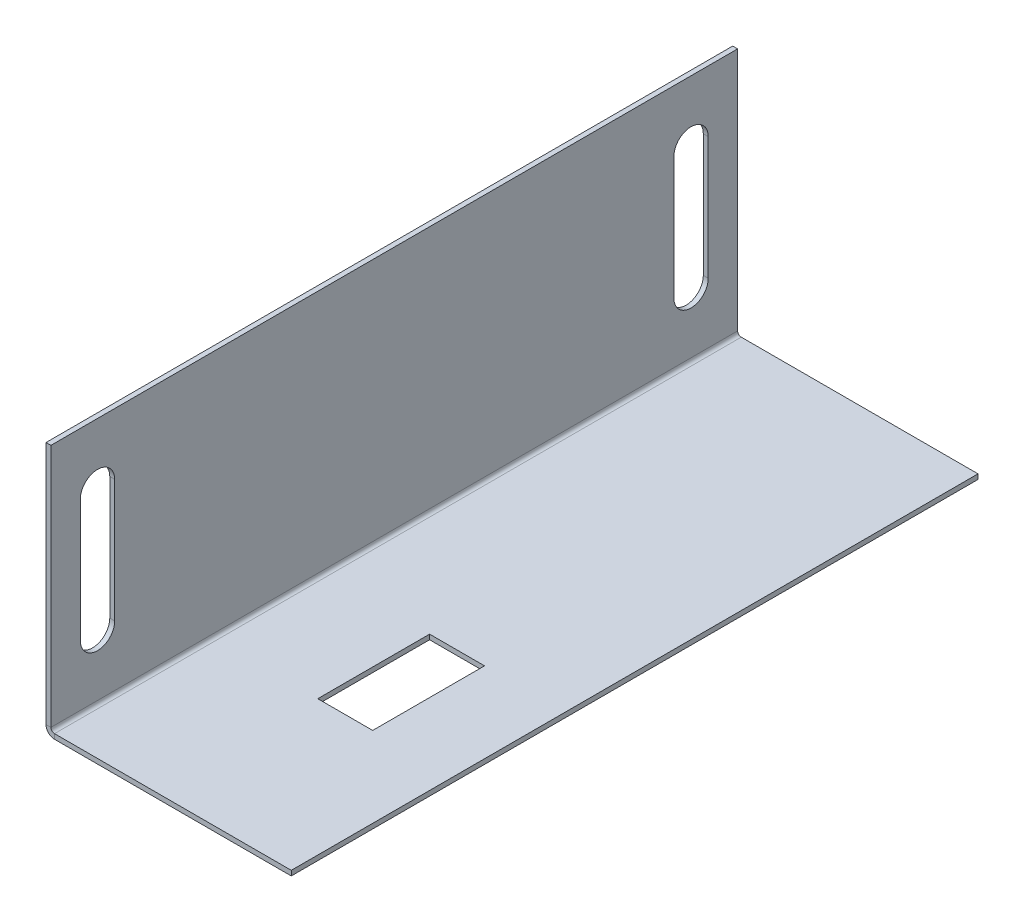
ISO-10303-21;
HEADER;
FILE_DESCRIPTION(('STEP AP214'),'2;1');
FILE_NAME('part.step','',(''),(''),'','','');
FILE_SCHEMA(('AUTOMOTIVE_DESIGN { 1 0 10303 214 1 1 1 1 }'));
ENDSEC;
DATA;
#1=APPLICATION_CONTEXT('core data for automotive mechanical design processes');
#2=APPLICATION_PROTOCOL_DEFINITION('international standard','automotive_design',2000,#1);
#3=PRODUCT_CONTEXT('',#1,'mechanical');
#4=PRODUCT('Part','Part','',(#3));
#5=PRODUCT_RELATED_PRODUCT_CATEGORY('part','',(#4));
#6=PRODUCT_DEFINITION_FORMATION('','',#4);
#7=PRODUCT_DEFINITION_CONTEXT('part definition',#1,'design');
#8=PRODUCT_DEFINITION('design','',#6,#7);
#9=PRODUCT_DEFINITION_SHAPE('','',#8);
#10=(LENGTH_UNIT() NAMED_UNIT(*) SI_UNIT(.MILLI.,.METRE.));
#11=(NAMED_UNIT(*) PLANE_ANGLE_UNIT() SI_UNIT($,.RADIAN.));
#12=(NAMED_UNIT(*) SI_UNIT($,.STERADIAN.) SOLID_ANGLE_UNIT());
#13=UNCERTAINTY_MEASURE_WITH_UNIT(LENGTH_MEASURE(1.E-05),#10,'distance_accuracy_value','');
#14=(GEOMETRIC_REPRESENTATION_CONTEXT(3) GLOBAL_UNCERTAINTY_ASSIGNED_CONTEXT((#13)) GLOBAL_UNIT_ASSIGNED_CONTEXT((#10,
#11,#12)) REPRESENTATION_CONTEXT('',''));
#15=CARTESIAN_POINT('',(0.,0.,0.));
#16=DIRECTION('',(0.,0.,1.));
#17=DIRECTION('',(1.,0.,0.));
#18=AXIS2_PLACEMENT_3D('',#15,#16,#17);
#19=CARTESIAN_POINT('',(50.0000000000002,50.5307532622854,-140.));
#20=DIRECTION('',(0.,0.,-1.));
#21=DIRECTION('',(0.,1.,0.));
#22=AXIS2_PLACEMENT_3D('',#19,#20,#21);
#23=PLANE('',#22);
#24=DIRECTION('',(0.,1.,0.));
#25=VECTOR('',#24,1.);
#26=CARTESIAN_POINT('',(51.0000000000002,50.5307532622854,-140.));
#27=LINE('',#26,#25);
#28=CARTESIAN_POINT('',(51.,0.736600000000005,-140.));
#29=VERTEX_POINT('',#28);
#30=CARTESIAN_POINT('',(51.0000000000002,50.5307532622854,-140.));
#31=VERTEX_POINT('',#30);
#32=EDGE_CURVE('E328',#29,#31,#27,.T.);
#33=ORIENTED_EDGE('',*,*,#32,.F.);
#34=DIRECTION('',(-1.,0.,0.));
#35=VECTOR('',#34,1.);
#36=CARTESIAN_POINT('',(50.,0.736600000000004,-140.));
#37=LINE('',#36,#35);
#38=CARTESIAN_POINT('',(50.,0.736600000000011,-140.));
#39=VERTEX_POINT('',#38);
#40=EDGE_CURVE('E340',#29,#39,#37,.T.);
#41=ORIENTED_EDGE('',*,*,#40,.T.);
#42=DIRECTION('',(0.,1.,0.));
#43=VECTOR('',#42,1.);
#44=CARTESIAN_POINT('',(50.0000000000002,50.5307532622854,-140.));
#45=LINE('',#44,#43);
#46=CARTESIAN_POINT('',(50.0000000000002,50.5307532622854,-140.));
#47=VERTEX_POINT('',#46);
#48=EDGE_CURVE('E46',#39,#47,#45,.T.);
#49=ORIENTED_EDGE('',*,*,#48,.T.);
#50=DIRECTION('',(1.,0.,0.));
#51=VECTOR('',#50,1.);
#52=CARTESIAN_POINT('',(50.0000000000002,50.5307532622854,-140.));
#53=LINE('',#52,#51);
#54=EDGE_CURVE('E332',#47,#31,#53,.T.);
#55=ORIENTED_EDGE('',*,*,#54,.T.);
#56=EDGE_LOOP('',(#33,#41,#49,#55));
#57=FACE_BOUND('',#56,.T.);
#58=ADVANCED_FACE('F42',(#57),#23,.T.);
#59=CARTESIAN_POINT('',(50.0000000000002,50.5307532622854,0.));
#60=DIRECTION('',(0.,0.,1.));
#61=DIRECTION('',(0.,-1.,0.));
#62=AXIS2_PLACEMENT_3D('',#59,#60,#61);
#63=PLANE('',#62);
#64=DIRECTION('',(0.,-1.,0.));
#65=VECTOR('',#64,1.);
#66=CARTESIAN_POINT('',(50.0000000000002,50.5307532622854,0.));
#67=LINE('',#66,#65);
#68=CARTESIAN_POINT('',(50.0000000000002,50.5307532622854,0.));
#69=VERTEX_POINT('',#68);
#70=CARTESIAN_POINT('',(50.,0.736600000000004,0.));
#71=VERTEX_POINT('',#70);
#72=EDGE_CURVE('E327',#69,#71,#67,.T.);
#73=ORIENTED_EDGE('',*,*,#72,.T.);
#74=DIRECTION('',(1.,0.,0.));
#75=VECTOR('',#74,1.);
#76=CARTESIAN_POINT('',(50.,0.736600000000004,0.));
#77=LINE('',#76,#75);
#78=CARTESIAN_POINT('',(51.,0.736600000000005,0.));
#79=VERTEX_POINT('',#78);
#80=EDGE_CURVE('E12',#71,#79,#77,.T.);
#81=ORIENTED_EDGE('',*,*,#80,.T.);
#82=DIRECTION('',(0.,-1.,0.));
#83=VECTOR('',#82,1.);
#84=CARTESIAN_POINT('',(51.0000000000002,50.5307532622854,0.));
#85=LINE('',#84,#83);
#86=CARTESIAN_POINT('',(51.0000000000002,50.5307532622854,0.));
#87=VERTEX_POINT('',#86);
#88=EDGE_CURVE('E331',#87,#79,#85,.T.);
#89=ORIENTED_EDGE('',*,*,#88,.F.);
#90=DIRECTION('',(1.,0.,0.));
#91=VECTOR('',#90,1.);
#92=CARTESIAN_POINT('',(50.0000000000002,50.5307532622854,0.));
#93=LINE('',#92,#91);
#94=EDGE_CURVE('E336',#69,#87,#93,.T.);
#95=ORIENTED_EDGE('',*,*,#94,.F.);
#96=EDGE_LOOP('',(#73,#81,#89,#95));
#97=FACE_BOUND('',#96,.T.);
#98=ADVANCED_FACE('F44',(#97),#63,.T.);
#99=CARTESIAN_POINT('',(50.0000000000002,50.5307532622854,0.));
#100=DIRECTION('',(-1.,0.,0.));
#101=DIRECTION('',(0.,0.,-1.));
#102=AXIS2_PLACEMENT_3D('',#99,#100,#101);
#103=PLANE('',#102);
#104=CARTESIAN_POINT('',(50.0000000000001,38.0307532622854,-130.5));
#105=DIRECTION('',(-1.,0.,0.));
#106=DIRECTION('',(0.,-1.,0.));
#107=AXIS2_PLACEMENT_3D('',#104,#105,#106);
#108=CIRCLE('',#107,3.5);
#109=CARTESIAN_POINT('',(50.0000000000001,38.0307532622854,-134.));
#110=VERTEX_POINT('',#109);
#111=CARTESIAN_POINT('',(50.0000000000001,38.0307532622854,-127.));
#112=VERTEX_POINT('',#111);
#113=EDGE_CURVE('E223',#110,#112,#108,.F.);
#114=ORIENTED_EDGE('',*,*,#113,.T.);
#115=DIRECTION('',(0.,-1.,0.));
#116=VECTOR('',#115,1.);
#117=CARTESIAN_POINT('',(50.0000000000001,38.0307532622854,-127.));
#118=LINE('',#117,#116);
#119=CARTESIAN_POINT('',(50.,13.0307532622854,-127.));
#120=VERTEX_POINT('',#119);
#121=EDGE_CURVE('E240',#112,#120,#118,.T.);
#122=ORIENTED_EDGE('',*,*,#121,.T.);
#123=CARTESIAN_POINT('',(50.,13.0307532622854,-130.5));
#124=DIRECTION('',(-1.,0.,0.));
#125=DIRECTION('',(0.,-1.,0.));
#126=AXIS2_PLACEMENT_3D('',#123,#124,#125);
#127=CIRCLE('',#126,3.5);
#128=CARTESIAN_POINT('',(50.,13.0307532622854,-134.));
#129=VERTEX_POINT('',#128);
#130=EDGE_CURVE('E195',#120,#129,#127,.F.);
#131=ORIENTED_EDGE('',*,*,#130,.T.);
#132=DIRECTION('',(0.,1.,0.));
#133=VECTOR('',#132,1.);
#134=CARTESIAN_POINT('',(50.0000000000001,38.0307532622854,-134.));
#135=LINE('',#134,#133);
#136=EDGE_CURVE('E220',#129,#110,#135,.T.);
#137=ORIENTED_EDGE('',*,*,#136,.T.);
#138=EDGE_LOOP('',(#114,#122,#131,#137));
#139=FACE_BOUND('',#138,.T.);
#140=CARTESIAN_POINT('',(50.0000000000001,38.0307532622854,-9.50000000000001));
#141=DIRECTION('',(-1.,0.,0.));
#142=DIRECTION('',(0.,-1.,0.));
#143=AXIS2_PLACEMENT_3D('',#140,#141,#142);
#144=CIRCLE('',#143,3.5);
#145=CARTESIAN_POINT('',(50.0000000000001,38.0307532622854,-13.));
#146=VERTEX_POINT('',#145);
#147=CARTESIAN_POINT('',(50.0000000000001,38.0307532622854,-6.00000000000001));
#148=VERTEX_POINT('',#147);
#149=EDGE_CURVE('E255',#146,#148,#144,.F.);
#150=ORIENTED_EDGE('',*,*,#149,.T.);
#151=DIRECTION('',(0.,-1.,0.));
#152=VECTOR('',#151,1.);
#153=CARTESIAN_POINT('',(50.0000000000001,38.0307532622854,-6.00000000000001));
#154=LINE('',#153,#152);
#155=CARTESIAN_POINT('',(50.,13.0307532622854,-6.00000000000001));
#156=VERTEX_POINT('',#155);
#157=EDGE_CURVE('E272',#148,#156,#154,.T.);
#158=ORIENTED_EDGE('',*,*,#157,.T.);
#159=CARTESIAN_POINT('',(50.,13.0307532622854,-9.50000000000001));
#160=DIRECTION('',(-1.,0.,0.));
#161=DIRECTION('',(0.,-1.,0.));
#162=AXIS2_PLACEMENT_3D('',#159,#160,#161);
#163=CIRCLE('',#162,3.5);
#164=CARTESIAN_POINT('',(50.,13.0307532622854,-13.));
#165=VERTEX_POINT('',#164);
#166=EDGE_CURVE('E249',#156,#165,#163,.F.);
#167=ORIENTED_EDGE('',*,*,#166,.T.);
#168=DIRECTION('',(0.,1.,0.));
#169=VECTOR('',#168,1.);
#170=CARTESIAN_POINT('',(50.0000000000001,38.0307532622854,-13.));
#171=LINE('',#170,#169);
#172=EDGE_CURVE('E252',#165,#146,#171,.T.);
#173=ORIENTED_EDGE('',*,*,#172,.T.);
#174=EDGE_LOOP('',(#150,#158,#167,#173));
#175=FACE_BOUND('',#174,.T.);
#176=ORIENTED_EDGE('',*,*,#48,.F.);
#177=DIRECTION('',(0.,0.,1.));
#178=VECTOR('',#177,1.);
#179=CARTESIAN_POINT('',(50.,0.736600000000004,0.));
#180=LINE('',#179,#178);
#181=EDGE_CURVE('E335',#39,#71,#180,.T.);
#182=ORIENTED_EDGE('',*,*,#181,.T.);
#183=ORIENTED_EDGE('',*,*,#72,.F.);
#184=DIRECTION('',(0.,0.,1.));
#185=VECTOR('',#184,1.);
#186=CARTESIAN_POINT('',(50.0000000000002,50.5307532622854,0.));
#187=LINE('',#186,#185);
#188=EDGE_CURVE('E324',#47,#69,#187,.T.);
#189=ORIENTED_EDGE('',*,*,#188,.F.);
#190=EDGE_LOOP('',(#176,#182,#183,#189));
#191=FACE_BOUND('',#190,.T.);
#192=ADVANCED_FACE('F367',(#139,#175,#191),#103,.T.);
#193=CARTESIAN_POINT('',(50.0000000000002,50.5307532622854,0.));
#194=DIRECTION('',(0.,1.,0.));
#195=DIRECTION('',(0.,0.,1.));
#196=AXIS2_PLACEMENT_3D('',#193,#194,#195);
#197=PLANE('',#196);
#198=DIRECTION('',(0.,0.,1.));
#199=VECTOR('',#198,1.);
#200=CARTESIAN_POINT('',(51.0000000000002,50.5307532622854,0.));
#201=LINE('',#200,#199);
#202=EDGE_CURVE('E296',#31,#87,#201,.T.);
#203=ORIENTED_EDGE('',*,*,#202,.F.);
#204=ORIENTED_EDGE('',*,*,#54,.F.);
#205=ORIENTED_EDGE('',*,*,#188,.T.);
#206=ORIENTED_EDGE('',*,*,#94,.T.);
#207=EDGE_LOOP('',(#203,#204,#205,#206));
#208=FACE_BOUND('',#207,.T.);
#209=ADVANCED_FACE('F357',(#208),#197,.T.);
#210=CARTESIAN_POINT('',(51.0000000000002,50.5307532622854,0.));
#211=DIRECTION('',(-1.,0.,0.));
#212=DIRECTION('',(0.,0.,-1.));
#213=AXIS2_PLACEMENT_3D('',#210,#211,#212);
#214=PLANE('',#213);
#215=DIRECTION('',(0.,-1.,0.));
#216=VECTOR('',#215,1.);
#217=CARTESIAN_POINT('',(51.0000000000001,38.0307532622854,-127.));
#218=LINE('',#217,#216);
#219=CARTESIAN_POINT('',(51.0000000000001,38.0307532622854,-127.));
#220=VERTEX_POINT('',#219);
#221=CARTESIAN_POINT('',(51.,13.0307532622854,-127.));
#222=VERTEX_POINT('',#221);
#223=EDGE_CURVE('E228',#220,#222,#218,.T.);
#224=ORIENTED_EDGE('',*,*,#223,.F.);
#225=CARTESIAN_POINT('',(51.0000000000001,38.0307532622854,-130.5));
#226=DIRECTION('',(1.,0.,0.));
#227=DIRECTION('',(0.,-1.,0.));
#228=AXIS2_PLACEMENT_3D('',#225,#226,#227);
#229=CIRCLE('',#228,3.5);
#230=CARTESIAN_POINT('',(51.0000000000001,38.0307532622854,-134.));
#231=VERTEX_POINT('',#230);
#232=EDGE_CURVE('E226',#231,#220,#229,.T.);
#233=ORIENTED_EDGE('',*,*,#232,.F.);
#234=DIRECTION('',(0.,1.,0.));
#235=VECTOR('',#234,1.);
#236=CARTESIAN_POINT('',(51.0000000000001,38.0307532622854,-134.));
#237=LINE('',#236,#235);
#238=CARTESIAN_POINT('',(51.,13.0307532622854,-134.));
#239=VERTEX_POINT('',#238);
#240=EDGE_CURVE('E234',#239,#231,#237,.T.);
#241=ORIENTED_EDGE('',*,*,#240,.F.);
#242=CARTESIAN_POINT('',(51.,13.0307532622854,-130.5));
#243=DIRECTION('',(1.,0.,0.));
#244=DIRECTION('',(0.,-1.,0.));
#245=AXIS2_PLACEMENT_3D('',#242,#243,#244);
#246=CIRCLE('',#245,3.5);
#247=EDGE_CURVE('E231',#222,#239,#246,.T.);
#248=ORIENTED_EDGE('',*,*,#247,.F.);
#249=EDGE_LOOP('',(#224,#233,#241,#248));
#250=FACE_BOUND('',#249,.T.);
#251=DIRECTION('',(0.,-1.,0.));
#252=VECTOR('',#251,1.);
#253=CARTESIAN_POINT('',(51.0000000000001,38.0307532622854,-6.00000000000001));
#254=LINE('',#253,#252);
#255=CARTESIAN_POINT('',(51.0000000000001,38.0307532622854,-6.00000000000001));
#256=VERTEX_POINT('',#255);
#257=CARTESIAN_POINT('',(51.,13.0307532622854,-6.00000000000001));
#258=VERTEX_POINT('',#257);
#259=EDGE_CURVE('E260',#256,#258,#254,.T.);
#260=ORIENTED_EDGE('',*,*,#259,.F.);
#261=CARTESIAN_POINT('',(51.0000000000001,38.0307532622854,-9.50000000000001));
#262=DIRECTION('',(1.,0.,0.));
#263=DIRECTION('',(0.,1.,0.));
#264=AXIS2_PLACEMENT_3D('',#261,#262,#263);
#265=CIRCLE('',#264,3.5);
#266=CARTESIAN_POINT('',(51.0000000000001,38.0307532622854,-13.));
#267=VERTEX_POINT('',#266);
#268=EDGE_CURVE('E258',#267,#256,#265,.T.);
#269=ORIENTED_EDGE('',*,*,#268,.F.);
#270=DIRECTION('',(0.,1.,0.));
#271=VECTOR('',#270,1.);
#272=CARTESIAN_POINT('',(51.0000000000001,38.0307532622854,-13.));
#273=LINE('',#272,#271);
#274=CARTESIAN_POINT('',(51.,13.0307532622854,-13.));
#275=VERTEX_POINT('',#274);
#276=EDGE_CURVE('E266',#275,#267,#273,.T.);
#277=ORIENTED_EDGE('',*,*,#276,.F.);
#278=CARTESIAN_POINT('',(51.,13.0307532622854,-9.50000000000001));
#279=DIRECTION('',(1.,0.,0.));
#280=DIRECTION('',(0.,1.,0.));
#281=AXIS2_PLACEMENT_3D('',#278,#279,#280);
#282=CIRCLE('',#281,3.5);
#283=EDGE_CURVE('E263',#258,#275,#282,.T.);
#284=ORIENTED_EDGE('',*,*,#283,.F.);
#285=EDGE_LOOP('',(#260,#269,#277,#284));
#286=FACE_BOUND('',#285,.T.);
#287=DIRECTION('',(0.,0.,1.));
#288=VECTOR('',#287,1.);
#289=CARTESIAN_POINT('',(51.,0.736599999999997,0.));
#290=LINE('',#289,#288);
#291=EDGE_CURVE('E51',#29,#79,#290,.T.);
#292=ORIENTED_EDGE('',*,*,#291,.F.);
#293=ORIENTED_EDGE('',*,*,#32,.T.);
#294=ORIENTED_EDGE('',*,*,#202,.T.);
#295=ORIENTED_EDGE('',*,*,#88,.T.);
#296=EDGE_LOOP('',(#292,#293,#294,#295));
#297=FACE_BOUND('',#296,.T.);
#298=ADVANCED_FACE('F350',(#250,#286,#297),#214,.F.);
#299=CARTESIAN_POINT('',(100.,-1.,0.));
#300=DIRECTION('',(1.,0.,0.));
#301=DIRECTION('',(0.,0.,-1.));
#302=AXIS2_PLACEMENT_3D('',#299,#300,#301);
#303=PLANE('',#302);
#304=DIRECTION('',(0.,0.,-1.));
#305=VECTOR('',#304,1.);
#306=CARTESIAN_POINT('',(100.,0.,0.));
#307=LINE('',#306,#305);
#308=CARTESIAN_POINT('',(100.,0.,0.));
#309=VERTEX_POINT('',#308);
#310=CARTESIAN_POINT('',(100.,0.,-140.));
#311=VERTEX_POINT('',#310);
#312=EDGE_CURVE('E299',#309,#311,#307,.T.);
#313=ORIENTED_EDGE('',*,*,#312,.F.);
#314=DIRECTION('',(0.,1.,0.));
#315=VECTOR('',#314,1.);
#316=CARTESIAN_POINT('',(100.,-1.,0.));
#317=LINE('',#316,#315);
#318=CARTESIAN_POINT('',(100.,-1.,0.));
#319=VERTEX_POINT('',#318);
#320=EDGE_CURVE('E293',#319,#309,#317,.T.);
#321=ORIENTED_EDGE('',*,*,#320,.F.);
#322=DIRECTION('',(0.,0.,-1.));
#323=VECTOR('',#322,1.);
#324=CARTESIAN_POINT('',(100.,-1.,0.));
#325=LINE('',#324,#323);
#326=CARTESIAN_POINT('',(100.,-1.,-140.));
#327=VERTEX_POINT('',#326);
#328=EDGE_CURVE('E313',#319,#327,#325,.T.);
#329=ORIENTED_EDGE('',*,*,#328,.T.);
#330=DIRECTION('',(0.,1.,0.));
#331=VECTOR('',#330,1.);
#332=CARTESIAN_POINT('',(100.,-1.,-140.));
#333=LINE('',#332,#331);
#334=EDGE_CURVE('E311',#327,#311,#333,.T.);
#335=ORIENTED_EDGE('',*,*,#334,.T.);
#336=EDGE_LOOP('',(#313,#321,#329,#335));
#337=FACE_BOUND('',#336,.T.);
#338=ADVANCED_FACE('F392',(#337),#303,.T.);
#339=CARTESIAN_POINT('',(0.,-1.,0.));
#340=DIRECTION('',(0.,-1.,0.));
#341=DIRECTION('',(0.,0.,-1.));
#342=AXIS2_PLACEMENT_3D('',#339,#340,#341);
#343=PLANE('',#342);
#344=DIRECTION('',(0.,0.,1.));
#345=VECTOR('',#344,1.);
#346=CARTESIAN_POINT('',(83.6,-1.,-55.8));
#347=LINE('',#346,#345);
#348=CARTESIAN_POINT('',(83.6,-1.,-55.8));
#349=VERTEX_POINT('',#348);
#350=CARTESIAN_POINT('',(83.6,-1.,-33.));
#351=VERTEX_POINT('',#350);
#352=EDGE_CURVE('E59',#349,#351,#347,.T.);
#353=ORIENTED_EDGE('',*,*,#352,.F.);
#354=DIRECTION('',(1.,0.,0.));
#355=VECTOR('',#354,1.);
#356=CARTESIAN_POINT('',(72.4,-1.,-55.8));
#357=LINE('',#356,#355);
#358=CARTESIAN_POINT('',(72.4,-1.,-55.8));
#359=VERTEX_POINT('',#358);
#360=EDGE_CURVE('E189',#359,#349,#357,.T.);
#361=ORIENTED_EDGE('',*,*,#360,.F.);
#362=DIRECTION('',(0.,0.,-1.));
#363=VECTOR('',#362,1.);
#364=CARTESIAN_POINT('',(72.4,-1.,-55.8));
#365=LINE('',#364,#363);
#366=CARTESIAN_POINT('',(72.4,-1.,-33.));
#367=VERTEX_POINT('',#366);
#368=EDGE_CURVE('E209',#367,#359,#365,.T.);
#369=ORIENTED_EDGE('',*,*,#368,.F.);
#370=DIRECTION('',(-1.,0.,0.));
#371=VECTOR('',#370,1.);
#372=CARTESIAN_POINT('',(72.4,-1.,-33.));
#373=LINE('',#372,#371);
#374=EDGE_CURVE('E203',#351,#367,#373,.T.);
#375=ORIENTED_EDGE('',*,*,#374,.F.);
#376=EDGE_LOOP('',(#353,#361,#369,#375));
#377=FACE_BOUND('',#376,.T.);
#378=DIRECTION('',(0.,0.,1.));
#379=VECTOR('',#378,1.);
#380=CARTESIAN_POINT('',(51.7366,-1.,0.));
#381=LINE('',#380,#379);
#382=CARTESIAN_POINT('',(51.7366,-0.999999999999999,-140.));
#383=VERTEX_POINT('',#382);
#384=CARTESIAN_POINT('',(51.7366,-1.,0.));
#385=VERTEX_POINT('',#384);
#386=EDGE_CURVE('E288',#383,#385,#381,.T.);
#387=ORIENTED_EDGE('',*,*,#386,.F.);
#388=DIRECTION('',(-1.,0.,0.));
#389=VECTOR('',#388,1.);
#390=CARTESIAN_POINT('',(0.,-1.,-140.));
#391=LINE('',#390,#389);
#392=EDGE_CURVE('E309',#327,#383,#391,.T.);
#393=ORIENTED_EDGE('',*,*,#392,.F.);
#394=ORIENTED_EDGE('',*,*,#328,.F.);
#395=DIRECTION('',(1.,0.,0.));
#396=VECTOR('',#395,1.);
#397=CARTESIAN_POINT('',(0.,-1.,0.));
#398=LINE('',#397,#396);
#399=EDGE_CURVE('E297',#385,#319,#398,.T.);
#400=ORIENTED_EDGE('',*,*,#399,.F.);
#401=EDGE_LOOP('',(#387,#393,#394,#400));
#402=FACE_BOUND('',#401,.T.);
#403=ADVANCED_FACE('F388',(#377,#402),#343,.T.);
#404=CARTESIAN_POINT('',(0.,-1.,-140.));
#405=DIRECTION('',(0.,0.,-1.));
#406=DIRECTION('',(-1.,0.,0.));
#407=AXIS2_PLACEMENT_3D('',#404,#405,#406);
#408=PLANE('',#407);
#409=DIRECTION('',(0.,-1.,0.));
#410=VECTOR('',#409,1.);
#411=CARTESIAN_POINT('',(51.7366,-1.,-140.));
#412=LINE('',#411,#410);
#413=CARTESIAN_POINT('',(51.7366,0.,-140.));
#414=VERTEX_POINT('',#413);
#415=EDGE_CURVE('E316',#414,#383,#412,.T.);
#416=ORIENTED_EDGE('',*,*,#415,.F.);
#417=DIRECTION('',(-1.,0.,0.));
#418=VECTOR('',#417,1.);
#419=CARTESIAN_POINT('',(0.,0.,-140.));
#420=LINE('',#419,#418);
#421=EDGE_CURVE('E307',#311,#414,#420,.T.);
#422=ORIENTED_EDGE('',*,*,#421,.F.);
#423=ORIENTED_EDGE('',*,*,#334,.F.);
#424=ORIENTED_EDGE('',*,*,#392,.T.);
#425=EDGE_LOOP('',(#416,#422,#423,#424));
#426=FACE_BOUND('',#425,.T.);
#427=ADVANCED_FACE('F378',(#426),#408,.T.);
#428=CARTESIAN_POINT('',(0.,0.,0.));
#429=DIRECTION('',(0.,-1.,0.));
#430=DIRECTION('',(0.,0.,-1.));
#431=AXIS2_PLACEMENT_3D('',#428,#429,#430);
#432=PLANE('',#431);
#433=DIRECTION('',(-1.,0.,0.));
#434=VECTOR('',#433,1.);
#435=CARTESIAN_POINT('',(72.4,0.,-55.8));
#436=LINE('',#435,#434);
#437=CARTESIAN_POINT('',(83.6,0.,-55.8));
#438=VERTEX_POINT('',#437);
#439=CARTESIAN_POINT('',(72.4,0.,-55.8));
#440=VERTEX_POINT('',#439);
#441=EDGE_CURVE('E201',#438,#440,#436,.T.);
#442=ORIENTED_EDGE('',*,*,#441,.F.);
#443=DIRECTION('',(0.,0.,-1.));
#444=VECTOR('',#443,1.);
#445=CARTESIAN_POINT('',(83.6,0.,-55.8));
#446=LINE('',#445,#444);
#447=CARTESIAN_POINT('',(83.6,0.,-33.));
#448=VERTEX_POINT('',#447);
#449=EDGE_CURVE('E183',#448,#438,#446,.T.);
#450=ORIENTED_EDGE('',*,*,#449,.F.);
#451=DIRECTION('',(1.,0.,0.));
#452=VECTOR('',#451,1.);
#453=CARTESIAN_POINT('',(72.4,0.,-33.));
#454=LINE('',#453,#452);
#455=CARTESIAN_POINT('',(72.4,0.,-33.));
#456=VERTEX_POINT('',#455);
#457=EDGE_CURVE('E192',#456,#448,#454,.T.);
#458=ORIENTED_EDGE('',*,*,#457,.F.);
#459=DIRECTION('',(0.,0.,1.));
#460=VECTOR('',#459,1.);
#461=CARTESIAN_POINT('',(72.4,0.,-55.8));
#462=LINE('',#461,#460);
#463=EDGE_CURVE('E67',#440,#456,#462,.T.);
#464=ORIENTED_EDGE('',*,*,#463,.F.);
#465=EDGE_LOOP('',(#442,#450,#458,#464));
#466=FACE_BOUND('',#465,.T.);
#467=ORIENTED_EDGE('',*,*,#421,.T.);
#468=DIRECTION('',(0.,0.,1.));
#469=VECTOR('',#468,1.);
#470=CARTESIAN_POINT('',(51.7366,0.,0.));
#471=LINE('',#470,#469);
#472=CARTESIAN_POINT('',(51.7366,0.,0.));
#473=VERTEX_POINT('',#472);
#474=EDGE_CURVE('E304',#414,#473,#471,.T.);
#475=ORIENTED_EDGE('',*,*,#474,.T.);
#476=DIRECTION('',(1.,0.,0.));
#477=VECTOR('',#476,1.);
#478=CARTESIAN_POINT('',(0.,0.,0.));
#479=LINE('',#478,#477);
#480=EDGE_CURVE('E302',#473,#309,#479,.T.);
#481=ORIENTED_EDGE('',*,*,#480,.T.);
#482=ORIENTED_EDGE('',*,*,#312,.T.);
#483=EDGE_LOOP('',(#467,#475,#481,#482));
#484=FACE_BOUND('',#483,.T.);
#485=ADVANCED_FACE('F198',(#466,#484),#432,.F.);
#486=CARTESIAN_POINT('',(0.,-1.,0.));
#487=DIRECTION('',(0.,0.,1.));
#488=DIRECTION('',(1.,0.,0.));
#489=AXIS2_PLACEMENT_3D('',#486,#487,#488);
#490=PLANE('',#489);
#491=DIRECTION('',(0.,1.,0.));
#492=VECTOR('',#491,1.);
#493=CARTESIAN_POINT('',(51.7366,-1.,0.));
#494=LINE('',#493,#492);
#495=EDGE_CURVE('E319',#385,#473,#494,.T.);
#496=ORIENTED_EDGE('',*,*,#495,.F.);
#497=ORIENTED_EDGE('',*,*,#399,.T.);
#498=ORIENTED_EDGE('',*,*,#320,.T.);
#499=ORIENTED_EDGE('',*,*,#480,.F.);
#500=EDGE_LOOP('',(#496,#497,#498,#499));
#501=FACE_BOUND('',#500,.T.);
#502=ADVANCED_FACE('F385',(#501),#490,.T.);
#503=CARTESIAN_POINT('',(51.7366,0.7366,-140.));
#504=DIRECTION('',(0.,0.,-1.));
#505=DIRECTION('',(-1.,0.,0.));
#506=AXIS2_PLACEMENT_3D('',#503,#504,#505);
#507=PLANE('',#506);
#508=ORIENTED_EDGE('',*,*,#40,.F.);
#509=CARTESIAN_POINT('',(51.7366,0.7366,-140.));
#510=DIRECTION('',(0.,0.,-1.));
#511=DIRECTION('',(-1.,0.,0.));
#512=AXIS2_PLACEMENT_3D('',#509,#510,#511);
#513=CIRCLE('',#512,0.7366);
#514=EDGE_CURVE('E281',#29,#414,#513,.F.);
#515=ORIENTED_EDGE('',*,*,#514,.T.);
#516=ORIENTED_EDGE('',*,*,#415,.T.);
#517=CARTESIAN_POINT('',(51.7366,0.7366,-140.));
#518=DIRECTION('',(0.,0.,1.));
#519=DIRECTION('',(-1.,0.,0.));
#520=AXIS2_PLACEMENT_3D('',#517,#518,#519);
#521=CIRCLE('',#520,1.7366);
#522=EDGE_CURVE('E282',#39,#383,#521,.T.);
#523=ORIENTED_EDGE('',*,*,#522,.F.);
#524=EDGE_LOOP('',(#508,#515,#516,#523));
#525=FACE_BOUND('',#524,.T.);
#526=ADVANCED_FACE('F372',(#525),#507,.T.);
#527=CARTESIAN_POINT('',(51.7366,0.7366,0.));
#528=DIRECTION('',(0.,0.,1.));
#529=DIRECTION('',(1.,0.,0.));
#530=AXIS2_PLACEMENT_3D('',#527,#528,#529);
#531=PLANE('',#530);
#532=CARTESIAN_POINT('',(51.7366,0.7366,0.));
#533=DIRECTION('',(0.,0.,-1.));
#534=DIRECTION('',(-1.,0.,0.));
#535=AXIS2_PLACEMENT_3D('',#532,#533,#534);
#536=CIRCLE('',#535,0.7366);
#537=EDGE_CURVE('E286',#473,#79,#536,.T.);
#538=ORIENTED_EDGE('',*,*,#537,.T.);
#539=ORIENTED_EDGE('',*,*,#80,.F.);
#540=CARTESIAN_POINT('',(51.7366,0.7366,0.));
#541=DIRECTION('',(0.,0.,-1.));
#542=DIRECTION('',(1.,0.,0.));
#543=AXIS2_PLACEMENT_3D('',#540,#541,#542);
#544=CIRCLE('',#543,1.7366);
#545=EDGE_CURVE('E285',#385,#71,#544,.T.);
#546=ORIENTED_EDGE('',*,*,#545,.F.);
#547=ORIENTED_EDGE('',*,*,#495,.T.);
#548=EDGE_LOOP('',(#538,#539,#546,#547));
#549=FACE_BOUND('',#548,.T.);
#550=ADVANCED_FACE('F364',(#549),#531,.T.);
#551=CARTESIAN_POINT('',(51.7366,0.7366,70.0170457456122));
#552=DIRECTION('',(0.,0.,-1.));
#553=DIRECTION('',(-1.,0.,0.));
#554=AXIS2_PLACEMENT_3D('',#551,#552,#553);
#555=CYLINDRICAL_SURFACE('',#554,1.7366);
#556=ORIENTED_EDGE('',*,*,#386,.T.);
#557=ORIENTED_EDGE('',*,*,#545,.T.);
#558=ORIENTED_EDGE('',*,*,#181,.F.);
#559=ORIENTED_EDGE('',*,*,#522,.T.);
#560=EDGE_LOOP('',(#556,#557,#558,#559));
#561=FACE_BOUND('',#560,.T.);
#562=ADVANCED_FACE('F370',(#561),#555,.T.);
#563=CARTESIAN_POINT('',(51.7366,0.7366,70.0170457456122));
#564=DIRECTION('',(0.,0.,-1.));
#565=DIRECTION('',(-1.,0.,0.));
#566=AXIS2_PLACEMENT_3D('',#563,#564,#565);
#567=CYLINDRICAL_SURFACE('',#566,0.7366);
#568=ORIENTED_EDGE('',*,*,#474,.F.);
#569=ORIENTED_EDGE('',*,*,#514,.F.);
#570=ORIENTED_EDGE('',*,*,#291,.T.);
#571=ORIENTED_EDGE('',*,*,#537,.F.);
#572=EDGE_LOOP('',(#568,#569,#570,#571));
#573=FACE_BOUND('',#572,.T.);
#574=ADVANCED_FACE('F382',(#573),#567,.F.);
#575=CARTESIAN_POINT('',(49.999,38.0307532622854,-9.50000000000001));
#576=DIRECTION('',(1.,0.,0.));
#577=DIRECTION('',(0.,1.,0.));
#578=AXIS2_PLACEMENT_3D('',#575,#576,#577);
#579=CYLINDRICAL_SURFACE('',#578,3.5);
#580=DIRECTION('',(1.,0.,0.));
#581=VECTOR('',#580,1.);
#582=CARTESIAN_POINT('',(49.999,38.0307532622854,-13.));
#583=LINE('',#582,#581);
#584=EDGE_CURVE('E270',#146,#267,#583,.T.);
#585=ORIENTED_EDGE('',*,*,#584,.T.);
#586=ORIENTED_EDGE('',*,*,#268,.T.);
#587=DIRECTION('',(1.,0.,0.));
#588=VECTOR('',#587,1.);
#589=CARTESIAN_POINT('',(49.999,38.0307532622854,-6.00000000000001));
#590=LINE('',#589,#588);
#591=EDGE_CURVE('E269',#148,#256,#590,.T.);
#592=ORIENTED_EDGE('',*,*,#591,.F.);
#593=ORIENTED_EDGE('',*,*,#149,.F.);
#594=EDGE_LOOP('',(#585,#586,#592,#593));
#595=FACE_BOUND('',#594,.T.);
#596=ADVANCED_FACE('F455',(#595),#579,.F.);
#597=CARTESIAN_POINT('',(49.999,38.0307532622854,-13.));
#598=DIRECTION('',(0.,0.,-1.));
#599=DIRECTION('',(-1.,0.,0.));
#600=AXIS2_PLACEMENT_3D('',#597,#598,#599);
#601=PLANE('',#600);
#602=DIRECTION('',(1.,0.,0.));
#603=VECTOR('',#602,1.);
#604=CARTESIAN_POINT('',(49.9989999999999,13.0307532622854,-13.));
#605=LINE('',#604,#603);
#606=EDGE_CURVE('E273',#165,#275,#605,.T.);
#607=ORIENTED_EDGE('',*,*,#606,.T.);
#608=ORIENTED_EDGE('',*,*,#276,.T.);
#609=ORIENTED_EDGE('',*,*,#584,.F.);
#610=ORIENTED_EDGE('',*,*,#172,.F.);
#611=EDGE_LOOP('',(#607,#608,#609,#610));
#612=FACE_BOUND('',#611,.T.);
#613=ADVANCED_FACE('F463',(#612),#601,.F.);
#614=CARTESIAN_POINT('',(49.9989999999999,13.0307532622854,-9.50000000000001));
#615=DIRECTION('',(1.,0.,0.));
#616=DIRECTION('',(0.,1.,0.));
#617=AXIS2_PLACEMENT_3D('',#614,#615,#616);
#618=CYLINDRICAL_SURFACE('',#617,3.5);
#619=DIRECTION('',(1.,0.,0.));
#620=VECTOR('',#619,1.);
#621=CARTESIAN_POINT('',(49.9989999999999,13.0307532622854,-6.00000000000001));
#622=LINE('',#621,#620);
#623=EDGE_CURVE('E275',#156,#258,#622,.T.);
#624=ORIENTED_EDGE('',*,*,#623,.T.);
#625=ORIENTED_EDGE('',*,*,#283,.T.);
#626=ORIENTED_EDGE('',*,*,#606,.F.);
#627=ORIENTED_EDGE('',*,*,#166,.F.);
#628=EDGE_LOOP('',(#624,#625,#626,#627));
#629=FACE_BOUND('',#628,.T.);
#630=ADVANCED_FACE('F472',(#629),#618,.F.);
#631=CARTESIAN_POINT('',(49.999,38.0307532622854,-6.00000000000001));
#632=DIRECTION('',(0.,0.,1.));
#633=DIRECTION('',(1.,0.,0.));
#634=AXIS2_PLACEMENT_3D('',#631,#632,#633);
#635=PLANE('',#634);
#636=ORIENTED_EDGE('',*,*,#591,.T.);
#637=ORIENTED_EDGE('',*,*,#259,.T.);
#638=ORIENTED_EDGE('',*,*,#623,.F.);
#639=ORIENTED_EDGE('',*,*,#157,.F.);
#640=EDGE_LOOP('',(#636,#637,#638,#639));
#641=FACE_BOUND('',#640,.T.);
#642=ADVANCED_FACE('F480',(#641),#635,.F.);
#643=CARTESIAN_POINT('',(49.9989999999999,38.0307532622854,-130.5));
#644=DIRECTION('',(1.,0.,0.));
#645=DIRECTION('',(0.,1.,0.));
#646=AXIS2_PLACEMENT_3D('',#643,#644,#645);
#647=CYLINDRICAL_SURFACE('',#646,3.5);
#648=DIRECTION('',(1.,0.,0.));
#649=VECTOR('',#648,1.);
#650=CARTESIAN_POINT('',(49.9989999999999,38.0307532622854,-134.));
#651=LINE('',#650,#649);
#652=EDGE_CURVE('E238',#110,#231,#651,.T.);
#653=ORIENTED_EDGE('',*,*,#652,.T.);
#654=ORIENTED_EDGE('',*,*,#232,.T.);
#655=DIRECTION('',(1.,0.,0.));
#656=VECTOR('',#655,1.);
#657=CARTESIAN_POINT('',(49.9989999999999,38.0307532622854,-127.));
#658=LINE('',#657,#656);
#659=EDGE_CURVE('E237',#112,#220,#658,.T.);
#660=ORIENTED_EDGE('',*,*,#659,.F.);
#661=ORIENTED_EDGE('',*,*,#113,.F.);
#662=EDGE_LOOP('',(#653,#654,#660,#661));
#663=FACE_BOUND('',#662,.T.);
#664=ADVANCED_FACE('F488',(#663),#647,.F.);
#665=CARTESIAN_POINT('',(49.9989999999999,38.0307532622854,-134.));
#666=DIRECTION('',(0.,0.,-1.));
#667=DIRECTION('',(-1.,0.,0.));
#668=AXIS2_PLACEMENT_3D('',#665,#666,#667);
#669=PLANE('',#668);
#670=DIRECTION('',(1.,0.,0.));
#671=VECTOR('',#670,1.);
#672=CARTESIAN_POINT('',(49.9989999999999,13.0307532622854,-134.));
#673=LINE('',#672,#671);
#674=EDGE_CURVE('E241',#129,#239,#673,.T.);
#675=ORIENTED_EDGE('',*,*,#674,.T.);
#676=ORIENTED_EDGE('',*,*,#240,.T.);
#677=ORIENTED_EDGE('',*,*,#652,.F.);
#678=ORIENTED_EDGE('',*,*,#136,.F.);
#679=EDGE_LOOP('',(#675,#676,#677,#678));
#680=FACE_BOUND('',#679,.T.);
#681=ADVANCED_FACE('F496',(#680),#669,.F.);
#682=CARTESIAN_POINT('',(49.9989999999999,13.0307532622854,-130.5));
#683=DIRECTION('',(1.,0.,0.));
#684=DIRECTION('',(0.,1.,0.));
#685=AXIS2_PLACEMENT_3D('',#682,#683,#684);
#686=CYLINDRICAL_SURFACE('',#685,3.5);
#687=DIRECTION('',(1.,0.,0.));
#688=VECTOR('',#687,1.);
#689=CARTESIAN_POINT('',(49.9989999999999,13.0307532622854,-127.));
#690=LINE('',#689,#688);
#691=EDGE_CURVE('E243',#120,#222,#690,.T.);
#692=ORIENTED_EDGE('',*,*,#691,.T.);
#693=ORIENTED_EDGE('',*,*,#247,.T.);
#694=ORIENTED_EDGE('',*,*,#674,.F.);
#695=ORIENTED_EDGE('',*,*,#130,.F.);
#696=EDGE_LOOP('',(#692,#693,#694,#695));
#697=FACE_BOUND('',#696,.T.);
#698=ADVANCED_FACE('F504',(#697),#686,.F.);
#699=CARTESIAN_POINT('',(49.9989999999999,38.0307532622854,-127.));
#700=DIRECTION('',(0.,0.,1.));
#701=DIRECTION('',(1.,0.,0.));
#702=AXIS2_PLACEMENT_3D('',#699,#700,#701);
#703=PLANE('',#702);
#704=ORIENTED_EDGE('',*,*,#659,.T.);
#705=ORIENTED_EDGE('',*,*,#223,.T.);
#706=ORIENTED_EDGE('',*,*,#691,.F.);
#707=ORIENTED_EDGE('',*,*,#121,.F.);
#708=EDGE_LOOP('',(#704,#705,#706,#707));
#709=FACE_BOUND('',#708,.T.);
#710=ADVANCED_FACE('F512',(#709),#703,.F.);
#711=CARTESIAN_POINT('',(83.6,50.5317532622854,-55.8));
#712=DIRECTION('',(1.,0.,0.));
#713=DIRECTION('',(0.,0.,-1.));
#714=AXIS2_PLACEMENT_3D('',#711,#712,#713);
#715=PLANE('',#714);
#716=ORIENTED_EDGE('',*,*,#449,.T.);
#717=DIRECTION('',(0.,-1.,0.));
#718=VECTOR('',#717,1.);
#719=CARTESIAN_POINT('',(83.6,50.5317532622854,-55.8));
#720=LINE('',#719,#718);
#721=EDGE_CURVE('E196',#438,#349,#720,.T.);
#722=ORIENTED_EDGE('',*,*,#721,.T.);
#723=ORIENTED_EDGE('',*,*,#352,.T.);
#724=DIRECTION('',(0.,-1.,0.));
#725=VECTOR('',#724,1.);
#726=CARTESIAN_POINT('',(83.6,50.5317532622854,-33.));
#727=LINE('',#726,#725);
#728=EDGE_CURVE('E179',#448,#351,#727,.T.);
#729=ORIENTED_EDGE('',*,*,#728,.F.);
#730=EDGE_LOOP('',(#716,#722,#723,#729));
#731=FACE_BOUND('',#730,.T.);
#732=ADVANCED_FACE('F181',(#731),#715,.F.);
#733=CARTESIAN_POINT('',(72.4,50.5317532622854,-55.8));
#734=DIRECTION('',(0.,0.,-1.));
#735=DIRECTION('',(-1.,0.,0.));
#736=AXIS2_PLACEMENT_3D('',#733,#734,#735);
#737=PLANE('',#736);
#738=ORIENTED_EDGE('',*,*,#441,.T.);
#739=DIRECTION('',(0.,-1.,0.));
#740=VECTOR('',#739,1.);
#741=CARTESIAN_POINT('',(72.4,50.5317532622854,-55.8));
#742=LINE('',#741,#740);
#743=EDGE_CURVE('E215',#440,#359,#742,.T.);
#744=ORIENTED_EDGE('',*,*,#743,.T.);
#745=ORIENTED_EDGE('',*,*,#360,.T.);
#746=ORIENTED_EDGE('',*,*,#721,.F.);
#747=EDGE_LOOP('',(#738,#744,#745,#746));
#748=FACE_BOUND('',#747,.T.);
#749=ADVANCED_FACE('F526',(#748),#737,.F.);
#750=CARTESIAN_POINT('',(72.4,50.5317532622854,-55.8));
#751=DIRECTION('',(-1.,0.,0.));
#752=DIRECTION('',(0.,0.,1.));
#753=AXIS2_PLACEMENT_3D('',#750,#751,#752);
#754=PLANE('',#753);
#755=ORIENTED_EDGE('',*,*,#463,.T.);
#756=DIRECTION('',(0.,-1.,0.));
#757=VECTOR('',#756,1.);
#758=CARTESIAN_POINT('',(72.4,50.5317532622854,-33.));
#759=LINE('',#758,#757);
#760=EDGE_CURVE('E188',#456,#367,#759,.T.);
#761=ORIENTED_EDGE('',*,*,#760,.T.);
#762=ORIENTED_EDGE('',*,*,#368,.T.);
#763=ORIENTED_EDGE('',*,*,#743,.F.);
#764=EDGE_LOOP('',(#755,#761,#762,#763));
#765=FACE_BOUND('',#764,.T.);
#766=ADVANCED_FACE('F533',(#765),#754,.F.);
#767=CARTESIAN_POINT('',(72.4,50.5317532622854,-33.));
#768=DIRECTION('',(0.,0.,1.));
#769=DIRECTION('',(1.,0.,0.));
#770=AXIS2_PLACEMENT_3D('',#767,#768,#769);
#771=PLANE('',#770);
#772=ORIENTED_EDGE('',*,*,#457,.T.);
#773=ORIENTED_EDGE('',*,*,#728,.T.);
#774=ORIENTED_EDGE('',*,*,#374,.T.);
#775=ORIENTED_EDGE('',*,*,#760,.F.);
#776=EDGE_LOOP('',(#772,#773,#774,#775));
#777=FACE_BOUND('',#776,.T.);
#778=ADVANCED_FACE('F193',(#777),#771,.F.);
#779=CLOSED_SHELL('',(#58,#98,#192,#209,#298,#338,#403,#427,#485,#502,#526,#550,#562,#574,#596,
#613,#630,#642,#664,#681,#698,#710,#732,#749,#766,#778));
#780=MANIFOLD_SOLID_BREP('B2',#779);
#781=ADVANCED_BREP_SHAPE_REPRESENTATION('',(#18,#780),#14);
#782=SHAPE_DEFINITION_REPRESENTATION(#9,#781);
ENDSEC;
END-ISO-10303-21;
